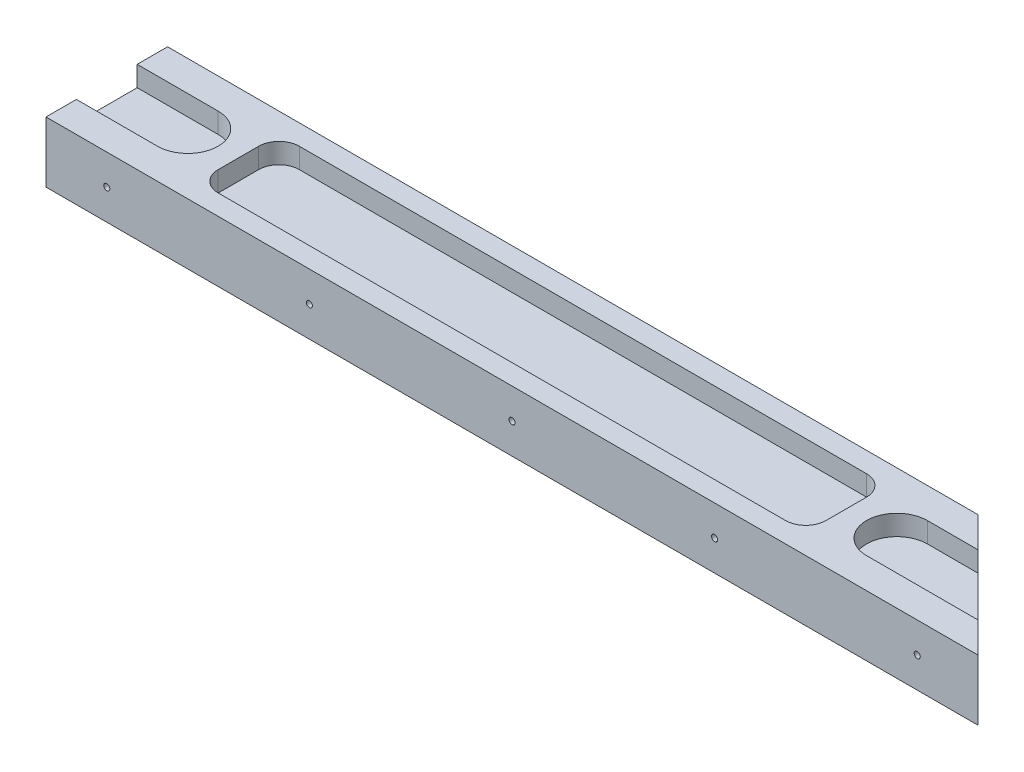
ISO-10303-21;
HEADER;
FILE_DESCRIPTION(('STEP AP214'),'2;1');
FILE_NAME('part.step','',(''),(''),'','','');
FILE_SCHEMA(('AUTOMOTIVE_DESIGN { 1 0 10303 214 1 1 1 1 }'));
ENDSEC;
DATA;
#1=APPLICATION_CONTEXT('core data for automotive mechanical design processes');
#2=APPLICATION_PROTOCOL_DEFINITION('international standard','automotive_design',2000,#1);
#3=PRODUCT_CONTEXT('',#1,'mechanical');
#4=PRODUCT('Part','Part','',(#3));
#5=PRODUCT_RELATED_PRODUCT_CATEGORY('part','',(#4));
#6=PRODUCT_DEFINITION_FORMATION('','',#4);
#7=PRODUCT_DEFINITION_CONTEXT('part definition',#1,'design');
#8=PRODUCT_DEFINITION('design','',#6,#7);
#9=PRODUCT_DEFINITION_SHAPE('','',#8);
#10=(LENGTH_UNIT() NAMED_UNIT(*) SI_UNIT(.MILLI.,.METRE.));
#11=(NAMED_UNIT(*) PLANE_ANGLE_UNIT() SI_UNIT($,.RADIAN.));
#12=(NAMED_UNIT(*) SI_UNIT($,.STERADIAN.) SOLID_ANGLE_UNIT());
#13=UNCERTAINTY_MEASURE_WITH_UNIT(LENGTH_MEASURE(1.E-05),#10,'distance_accuracy_value','');
#14=(GEOMETRIC_REPRESENTATION_CONTEXT(3) GLOBAL_UNCERTAINTY_ASSIGNED_CONTEXT((#13)) GLOBAL_UNIT_ASSIGNED_CONTEXT((#10,
#11,#12)) REPRESENTATION_CONTEXT('',''));
#15=CARTESIAN_POINT('',(0.,0.,0.));
#16=DIRECTION('',(0.,0.,1.));
#17=DIRECTION('',(1.,0.,0.));
#18=AXIS2_PLACEMENT_3D('',#15,#16,#17);
#19=CARTESIAN_POINT('',(0.,15.,-30.));
#20=DIRECTION('',(1.,0.,0.));
#21=DIRECTION('',(0.,0.,-1.));
#22=AXIS2_PLACEMENT_3D('',#19,#20,#21);
#23=PLANE('',#22);
#24=DIRECTION('',(0.,0.,1.));
#25=VECTOR('',#24,1.);
#26=CARTESIAN_POINT('',(0.,0.,-30.));
#27=LINE('',#26,#25);
#28=CARTESIAN_POINT('',(0.,0.,-30.));
#29=VERTEX_POINT('',#28);
#30=CARTESIAN_POINT('',(0.,0.,-22.5));
#31=VERTEX_POINT('',#30);
#32=EDGE_CURVE('E436',#29,#31,#27,.T.);
#33=ORIENTED_EDGE('',*,*,#32,.T.);
#34=DIRECTION('',(0.,-1.,0.));
#35=VECTOR('',#34,1.);
#36=CARTESIAN_POINT('',(0.,5.,-22.5));
#37=LINE('',#36,#35);
#38=CARTESIAN_POINT('',(0.,5.,-22.5));
#39=VERTEX_POINT('',#38);
#40=EDGE_CURVE('E355',#39,#31,#37,.T.);
#41=ORIENTED_EDGE('',*,*,#40,.F.);
#42=DIRECTION('',(0.,0.,-1.));
#43=VECTOR('',#42,1.);
#44=CARTESIAN_POINT('',(0.,5.,-22.5));
#45=LINE('',#44,#43);
#46=CARTESIAN_POINT('',(0.,5.,-7.5));
#47=VERTEX_POINT('',#46);
#48=EDGE_CURVE('E368',#47,#39,#45,.T.);
#49=ORIENTED_EDGE('',*,*,#48,.F.);
#50=DIRECTION('',(0.,-1.,0.));
#51=VECTOR('',#50,1.);
#52=CARTESIAN_POINT('',(0.,5.,-7.5));
#53=LINE('',#52,#51);
#54=CARTESIAN_POINT('',(0.,0.,-7.5));
#55=VERTEX_POINT('',#54);
#56=EDGE_CURVE('E352',#47,#55,#53,.T.);
#57=ORIENTED_EDGE('',*,*,#56,.T.);
#58=CARTESIAN_POINT('',(0.,0.,0.));
#59=VERTEX_POINT('',#58);
#60=EDGE_CURVE('E422',#55,#59,#27,.T.);
#61=ORIENTED_EDGE('',*,*,#60,.T.);
#62=DIRECTION('',(0.,-1.,0.));
#63=VECTOR('',#62,1.);
#64=CARTESIAN_POINT('',(0.,15.,0.));
#65=LINE('',#64,#63);
#66=CARTESIAN_POINT('',(0.,15.,0.));
#67=VERTEX_POINT('',#66);
#68=EDGE_CURVE('E455',#67,#59,#65,.T.);
#69=ORIENTED_EDGE('',*,*,#68,.F.);
#70=DIRECTION('',(0.,0.,1.));
#71=VECTOR('',#70,1.);
#72=CARTESIAN_POINT('',(0.,15.,-30.));
#73=LINE('',#72,#71);
#74=CARTESIAN_POINT('',(0.,15.,-7.50000000000001));
#75=VERTEX_POINT('',#74);
#76=EDGE_CURVE('E427',#75,#67,#73,.T.);
#77=ORIENTED_EDGE('',*,*,#76,.F.);
#78=DIRECTION('',(0.,-1.,0.));
#79=VECTOR('',#78,1.);
#80=CARTESIAN_POINT('',(0.,15.,-7.5));
#81=LINE('',#80,#79);
#82=CARTESIAN_POINT('',(0.,10.,-7.5));
#83=VERTEX_POINT('',#82);
#84=EDGE_CURVE('E416',#75,#83,#81,.T.);
#85=ORIENTED_EDGE('',*,*,#84,.T.);
#86=DIRECTION('',(0.,0.,1.));
#87=VECTOR('',#86,1.);
#88=CARTESIAN_POINT('',(0.,10.,-30.));
#89=LINE('',#88,#87);
#90=CARTESIAN_POINT('',(0.,10.,-22.5));
#91=VERTEX_POINT('',#90);
#92=EDGE_CURVE('E11',#91,#83,#89,.T.);
#93=ORIENTED_EDGE('',*,*,#92,.F.);
#94=DIRECTION('',(0.,1.,0.));
#95=VECTOR('',#94,1.);
#96=CARTESIAN_POINT('',(0.,15.,-22.5));
#97=LINE('',#96,#95);
#98=CARTESIAN_POINT('',(0.,15.,-22.5));
#99=VERTEX_POINT('',#98);
#100=EDGE_CURVE('E419',#91,#99,#97,.T.);
#101=ORIENTED_EDGE('',*,*,#100,.T.);
#102=CARTESIAN_POINT('',(0.,15.,-30.));
#103=VERTEX_POINT('',#102);
#104=EDGE_CURVE('E423',#103,#99,#73,.T.);
#105=ORIENTED_EDGE('',*,*,#104,.F.);
#106=DIRECTION('',(0.,-1.,0.));
#107=VECTOR('',#106,1.);
#108=CARTESIAN_POINT('',(0.,15.,-30.));
#109=LINE('',#108,#107);
#110=EDGE_CURVE('E435',#103,#29,#109,.T.);
#111=ORIENTED_EDGE('',*,*,#110,.T.);
#112=EDGE_LOOP('',(#33,#41,#49,#57,#61,#69,#77,#85,#93,#101,#105,#111));
#113=FACE_BOUND('',#112,.T.);
#114=ADVANCED_FACE('F39',(#113),#23,.F.);
#115=CARTESIAN_POINT('',(0.,15.,0.));
#116=DIRECTION('',(0.,0.,-1.));
#117=DIRECTION('',(-1.,0.,0.));
#118=AXIS2_PLACEMENT_3D('',#115,#116,#117);
#119=PLANE('',#118);
#120=CARTESIAN_POINT('',(15.,7.4999999999993,0.));
#121=DIRECTION('',(0.,0.,1.));
#122=DIRECTION('',(1.,0.,0.));
#123=AXIS2_PLACEMENT_3D('',#120,#121,#122);
#124=CIRCLE('',#123,0.749999999999999);
#125=CARTESIAN_POINT('',(15.75,7.4999999999993,0.));
#126=VERTEX_POINT('',#125);
#127=EDGE_CURVE('E308',#126,#126,#124,.T.);
#128=ORIENTED_EDGE('',*,*,#127,.F.);
#129=EDGE_LOOP('',(#128));
#130=FACE_BOUND('',#129,.T.);
#131=CARTESIAN_POINT('',(65.,7.49999999999965,0.));
#132=DIRECTION('',(0.,0.,1.));
#133=DIRECTION('',(1.,0.,0.));
#134=AXIS2_PLACEMENT_3D('',#131,#132,#133);
#135=CIRCLE('',#134,0.749999999999999);
#136=CARTESIAN_POINT('',(65.75,7.49999999999965,0.));
#137=VERTEX_POINT('',#136);
#138=EDGE_CURVE('E304',#137,#137,#135,.T.);
#139=ORIENTED_EDGE('',*,*,#138,.F.);
#140=EDGE_LOOP('',(#139));
#141=FACE_BOUND('',#140,.T.);
#142=CARTESIAN_POINT('',(215.,7.5,0.));
#143=DIRECTION('',(0.,0.,1.));
#144=DIRECTION('',(1.,0.,0.));
#145=AXIS2_PLACEMENT_3D('',#142,#143,#144);
#146=CIRCLE('',#145,0.749999999999985);
#147=CARTESIAN_POINT('',(215.75,7.5,0.));
#148=VERTEX_POINT('',#147);
#149=EDGE_CURVE('E298',#148,#148,#146,.T.);
#150=ORIENTED_EDGE('',*,*,#149,.F.);
#151=EDGE_LOOP('',(#150));
#152=FACE_BOUND('',#151,.T.);
#153=CARTESIAN_POINT('',(165.,7.5,0.));
#154=DIRECTION('',(0.,0.,1.));
#155=DIRECTION('',(1.,0.,0.));
#156=AXIS2_PLACEMENT_3D('',#153,#154,#155);
#157=CIRCLE('',#156,0.750000000000012);
#158=CARTESIAN_POINT('',(165.75,7.5,0.));
#159=VERTEX_POINT('',#158);
#160=EDGE_CURVE('E297',#159,#159,#157,.T.);
#161=ORIENTED_EDGE('',*,*,#160,.F.);
#162=EDGE_LOOP('',(#161));
#163=FACE_BOUND('',#162,.T.);
#164=CARTESIAN_POINT('',(115.,7.5,0.));
#165=DIRECTION('',(0.,0.,1.));
#166=DIRECTION('',(1.,0.,0.));
#167=AXIS2_PLACEMENT_3D('',#164,#165,#166);
#168=CIRCLE('',#167,0.749999999999999);
#169=CARTESIAN_POINT('',(115.75,7.5,0.));
#170=VERTEX_POINT('',#169);
#171=EDGE_CURVE('E301',#170,#170,#168,.T.);
#172=ORIENTED_EDGE('',*,*,#171,.F.);
#173=EDGE_LOOP('',(#172));
#174=FACE_BOUND('',#173,.T.);
#175=DIRECTION('',(1.,0.,0.));
#176=VECTOR('',#175,1.);
#177=CARTESIAN_POINT('',(0.,0.,0.));
#178=LINE('',#177,#176);
#179=CARTESIAN_POINT('',(230.,0.,0.));
#180=VERTEX_POINT('',#179);
#181=EDGE_CURVE('E439',#59,#180,#178,.T.);
#182=ORIENTED_EDGE('',*,*,#181,.T.);
#183=DIRECTION('',(0.,-1.,0.));
#184=VECTOR('',#183,1.);
#185=CARTESIAN_POINT('',(230.,15.,0.));
#186=LINE('',#185,#184);
#187=CARTESIAN_POINT('',(230.,15.,0.));
#188=VERTEX_POINT('',#187);
#189=EDGE_CURVE('E452',#188,#180,#186,.T.);
#190=ORIENTED_EDGE('',*,*,#189,.F.);
#191=DIRECTION('',(1.,0.,0.));
#192=VECTOR('',#191,1.);
#193=CARTESIAN_POINT('',(0.,15.,0.));
#194=LINE('',#193,#192);
#195=EDGE_CURVE('E426',#67,#188,#194,.T.);
#196=ORIENTED_EDGE('',*,*,#195,.F.);
#197=ORIENTED_EDGE('',*,*,#68,.T.);
#198=EDGE_LOOP('',(#182,#190,#196,#197));
#199=FACE_BOUND('',#198,.T.);
#200=ADVANCED_FACE('F532',(#130,#141,#152,#163,#174,#199),#119,.F.);
#201=CARTESIAN_POINT('',(230.,15.,0.));
#202=DIRECTION('',(-0.707106781186548,0.,0.707106781186547));
#203=DIRECTION('',(0.707106781186547,0.,0.707106781186548));
#204=AXIS2_PLACEMENT_3D('',#201,#202,#203);
#205=PLANE('',#204);
#206=CARTESIAN_POINT('',(215.,7.5,-15.));
#207=DIRECTION('',(-0.707106781186548,0.,0.707106781186547));
#208=DIRECTION('',(0.707106781186547,0.,0.707106781186548));
#209=AXIS2_PLACEMENT_3D('',#206,#207,#208);
#210=ELLIPSE('',#209,1.0606601717798,0.749999999999985);
#211=CARTESIAN_POINT('',(215.75,7.5,-14.25));
#212=VERTEX_POINT('',#211);
#213=EDGE_CURVE('E42',#212,#212,#210,.T.);
#214=ORIENTED_EDGE('',*,*,#213,.T.);
#215=EDGE_LOOP('',(#214));
#216=FACE_BOUND('',#215,.T.);
#217=DIRECTION('',(-0.707106781186547,0.,-0.707106781186548));
#218=VECTOR('',#217,1.);
#219=CARTESIAN_POINT('',(230.,0.,0.));
#220=LINE('',#219,#218);
#221=CARTESIAN_POINT('',(222.5,0.,-7.50000000000001));
#222=VERTEX_POINT('',#221);
#223=EDGE_CURVE('E442',#180,#222,#220,.T.);
#224=ORIENTED_EDGE('',*,*,#223,.T.);
#225=DIRECTION('',(0.,-1.,0.));
#226=VECTOR('',#225,1.);
#227=CARTESIAN_POINT('',(222.5,5.,-7.50000000000001));
#228=LINE('',#227,#226);
#229=CARTESIAN_POINT('',(222.5,5.,-7.50000000000001));
#230=VERTEX_POINT('',#229);
#231=EDGE_CURVE('E342',#230,#222,#228,.T.);
#232=ORIENTED_EDGE('',*,*,#231,.F.);
#233=DIRECTION('',(0.707106781186547,0.,0.707106781186548));
#234=VECTOR('',#233,1.);
#235=CARTESIAN_POINT('',(222.5,5.,-7.50000000000001));
#236=LINE('',#235,#234);
#237=CARTESIAN_POINT('',(207.5,5.,-22.5));
#238=VERTEX_POINT('',#237);
#239=EDGE_CURVE('E327',#238,#230,#236,.T.);
#240=ORIENTED_EDGE('',*,*,#239,.F.);
#241=DIRECTION('',(0.,-1.,0.));
#242=VECTOR('',#241,1.);
#243=CARTESIAN_POINT('',(207.5,5.,-22.5));
#244=LINE('',#243,#242);
#245=CARTESIAN_POINT('',(207.5,0.,-22.5));
#246=VERTEX_POINT('',#245);
#247=EDGE_CURVE('E344',#238,#246,#244,.T.);
#248=ORIENTED_EDGE('',*,*,#247,.T.);
#249=CARTESIAN_POINT('',(200.,0.,-30.));
#250=VERTEX_POINT('',#249);
#251=EDGE_CURVE('E441',#246,#250,#220,.T.);
#252=ORIENTED_EDGE('',*,*,#251,.T.);
#253=DIRECTION('',(0.,-1.,0.));
#254=VECTOR('',#253,1.);
#255=CARTESIAN_POINT('',(200.,15.,-30.));
#256=LINE('',#255,#254);
#257=CARTESIAN_POINT('',(200.,15.,-30.));
#258=VERTEX_POINT('',#257);
#259=EDGE_CURVE('E449',#258,#250,#256,.T.);
#260=ORIENTED_EDGE('',*,*,#259,.F.);
#261=DIRECTION('',(-0.707106781186547,0.,-0.707106781186548));
#262=VECTOR('',#261,1.);
#263=CARTESIAN_POINT('',(230.,15.,0.));
#264=LINE('',#263,#262);
#265=CARTESIAN_POINT('',(207.5,15.,-22.5));
#266=VERTEX_POINT('',#265);
#267=EDGE_CURVE('E429',#266,#258,#264,.T.);
#268=ORIENTED_EDGE('',*,*,#267,.F.);
#269=DIRECTION('',(0.,-1.,0.));
#270=VECTOR('',#269,1.);
#271=CARTESIAN_POINT('',(207.5,15.,-22.5));
#272=LINE('',#271,#270);
#273=CARTESIAN_POINT('',(207.5,10.,-22.5));
#274=VERTEX_POINT('',#273);
#275=EDGE_CURVE('E392',#266,#274,#272,.T.);
#276=ORIENTED_EDGE('',*,*,#275,.T.);
#277=DIRECTION('',(0.707106781186547,0.,0.707106781186548));
#278=VECTOR('',#277,1.);
#279=CARTESIAN_POINT('',(230.,10.,0.));
#280=LINE('',#279,#278);
#281=CARTESIAN_POINT('',(222.5,10.,-7.50000000000001));
#282=VERTEX_POINT('',#281);
#283=EDGE_CURVE('E47',#274,#282,#280,.T.);
#284=ORIENTED_EDGE('',*,*,#283,.T.);
#285=DIRECTION('',(0.,1.,0.));
#286=VECTOR('',#285,1.);
#287=CARTESIAN_POINT('',(222.5,15.,-7.5));
#288=LINE('',#287,#286);
#289=CARTESIAN_POINT('',(222.5,15.,-7.5));
#290=VERTEX_POINT('',#289);
#291=EDGE_CURVE('E413',#282,#290,#288,.T.);
#292=ORIENTED_EDGE('',*,*,#291,.T.);
#293=EDGE_CURVE('E430',#188,#290,#264,.T.);
#294=ORIENTED_EDGE('',*,*,#293,.F.);
#295=ORIENTED_EDGE('',*,*,#189,.T.);
#296=EDGE_LOOP('',(#224,#232,#240,#248,#252,#260,#268,#276,#284,#292,#294,#295));
#297=FACE_BOUND('',#296,.T.);
#298=ADVANCED_FACE('F464',(#216,#297),#205,.F.);
#299=CARTESIAN_POINT('',(200.,15.,-30.));
#300=DIRECTION('',(0.,0.,1.));
#301=DIRECTION('',(1.,0.,0.));
#302=AXIS2_PLACEMENT_3D('',#299,#300,#301);
#303=PLANE('',#302);
#304=CARTESIAN_POINT('',(15.,7.4999999999993,-30.));
#305=DIRECTION('',(0.,0.,1.));
#306=DIRECTION('',(1.,0.,0.));
#307=AXIS2_PLACEMENT_3D('',#304,#305,#306);
#308=CIRCLE('',#307,0.749999999999999);
#309=CARTESIAN_POINT('',(15.75,7.4999999999993,-30.));
#310=VERTEX_POINT('',#309);
#311=EDGE_CURVE('E282',#310,#310,#308,.F.);
#312=ORIENTED_EDGE('',*,*,#311,.F.);
#313=EDGE_LOOP('',(#312));
#314=FACE_BOUND('',#313,.T.);
#315=CARTESIAN_POINT('',(65.,7.49999999999965,-30.));
#316=DIRECTION('',(0.,0.,1.));
#317=DIRECTION('',(1.,0.,0.));
#318=AXIS2_PLACEMENT_3D('',#315,#316,#317);
#319=CIRCLE('',#318,0.749999999999999);
#320=CARTESIAN_POINT('',(65.75,7.49999999999965,-30.));
#321=VERTEX_POINT('',#320);
#322=EDGE_CURVE('E305',#321,#321,#319,.F.);
#323=ORIENTED_EDGE('',*,*,#322,.F.);
#324=EDGE_LOOP('',(#323));
#325=FACE_BOUND('',#324,.T.);
#326=CARTESIAN_POINT('',(165.,7.5,-30.));
#327=DIRECTION('',(0.,0.,1.));
#328=DIRECTION('',(1.,0.,0.));
#329=AXIS2_PLACEMENT_3D('',#326,#327,#328);
#330=CIRCLE('',#329,0.750000000000012);
#331=CARTESIAN_POINT('',(165.75,7.5,-30.));
#332=VERTEX_POINT('',#331);
#333=EDGE_CURVE('E294',#332,#332,#330,.F.);
#334=ORIENTED_EDGE('',*,*,#333,.F.);
#335=EDGE_LOOP('',(#334));
#336=FACE_BOUND('',#335,.T.);
#337=CARTESIAN_POINT('',(115.,7.5,-30.));
#338=DIRECTION('',(0.,0.,1.));
#339=DIRECTION('',(1.,0.,0.));
#340=AXIS2_PLACEMENT_3D('',#337,#338,#339);
#341=CIRCLE('',#340,0.749999999999999);
#342=CARTESIAN_POINT('',(115.75,7.5,-30.));
#343=VERTEX_POINT('',#342);
#344=EDGE_CURVE('E317',#343,#343,#341,.F.);
#345=ORIENTED_EDGE('',*,*,#344,.F.);
#346=EDGE_LOOP('',(#345));
#347=FACE_BOUND('',#346,.T.);
#348=DIRECTION('',(-1.,0.,0.));
#349=VECTOR('',#348,1.);
#350=CARTESIAN_POINT('',(200.,0.,-30.));
#351=LINE('',#350,#349);
#352=EDGE_CURVE('E445',#250,#29,#351,.T.);
#353=ORIENTED_EDGE('',*,*,#352,.T.);
#354=ORIENTED_EDGE('',*,*,#110,.F.);
#355=DIRECTION('',(-1.,0.,0.));
#356=VECTOR('',#355,1.);
#357=CARTESIAN_POINT('',(200.,15.,-30.));
#358=LINE('',#357,#356);
#359=EDGE_CURVE('E433',#258,#103,#358,.T.);
#360=ORIENTED_EDGE('',*,*,#359,.F.);
#361=ORIENTED_EDGE('',*,*,#259,.T.);
#362=EDGE_LOOP('',(#353,#354,#360,#361));
#363=FACE_BOUND('',#362,.T.);
#364=ADVANCED_FACE('F512',(#314,#325,#336,#347,#363),#303,.F.);
#365=CARTESIAN_POINT('',(0.,15.,0.));
#366=DIRECTION('',(0.,1.,0.));
#367=DIRECTION('',(0.,0.,1.));
#368=AXIS2_PLACEMENT_3D('',#365,#366,#367);
#369=PLANE('',#368);
#370=CARTESIAN_POINT('',(177.5,15.,-20.));
#371=DIRECTION('',(0.,1.,0.));
#372=DIRECTION('',(0.,0.,-1.));
#373=AXIS2_PLACEMENT_3D('',#370,#371,#372);
#374=CIRCLE('',#373,5.);
#375=CARTESIAN_POINT('',(182.5,15.,-20.));
#376=VERTEX_POINT('',#375);
#377=CARTESIAN_POINT('',(177.5,15.,-25.));
#378=VERTEX_POINT('',#377);
#379=EDGE_CURVE('E54',#376,#378,#374,.T.);
#380=ORIENTED_EDGE('',*,*,#379,.F.);
#381=DIRECTION('',(0.,0.,-1.));
#382=VECTOR('',#381,1.);
#383=CARTESIAN_POINT('',(182.5,15.,-20.));
#384=LINE('',#383,#382);
#385=CARTESIAN_POINT('',(182.5,15.,-10.));
#386=VERTEX_POINT('',#385);
#387=EDGE_CURVE('E244',#386,#376,#384,.T.);
#388=ORIENTED_EDGE('',*,*,#387,.F.);
#389=CARTESIAN_POINT('',(177.5,15.,-10.));
#390=DIRECTION('',(0.,1.,0.));
#391=DIRECTION('',(0.,0.,1.));
#392=AXIS2_PLACEMENT_3D('',#389,#390,#391);
#393=CIRCLE('',#392,5.);
#394=CARTESIAN_POINT('',(177.5,15.,-5.));
#395=VERTEX_POINT('',#394);
#396=EDGE_CURVE('E247',#395,#386,#393,.T.);
#397=ORIENTED_EDGE('',*,*,#396,.F.);
#398=DIRECTION('',(1.,0.,0.));
#399=VECTOR('',#398,1.);
#400=CARTESIAN_POINT('',(37.5,15.,-5.));
#401=LINE('',#400,#399);
#402=CARTESIAN_POINT('',(37.5,15.,-5.));
#403=VERTEX_POINT('',#402);
#404=EDGE_CURVE('E275',#403,#395,#401,.T.);
#405=ORIENTED_EDGE('',*,*,#404,.F.);
#406=CARTESIAN_POINT('',(37.5,15.,-10.));
#407=DIRECTION('',(0.,1.,0.));
#408=DIRECTION('',(0.,0.,1.));
#409=AXIS2_PLACEMENT_3D('',#406,#407,#408);
#410=CIRCLE('',#409,5.);
#411=CARTESIAN_POINT('',(32.5,15.,-10.));
#412=VERTEX_POINT('',#411);
#413=EDGE_CURVE('E272',#412,#403,#410,.T.);
#414=ORIENTED_EDGE('',*,*,#413,.F.);
#415=DIRECTION('',(0.,0.,1.));
#416=VECTOR('',#415,1.);
#417=CARTESIAN_POINT('',(32.5,15.,-20.));
#418=LINE('',#417,#416);
#419=CARTESIAN_POINT('',(32.5,15.,-20.));
#420=VERTEX_POINT('',#419);
#421=EDGE_CURVE('E269',#420,#412,#418,.T.);
#422=ORIENTED_EDGE('',*,*,#421,.F.);
#423=CARTESIAN_POINT('',(37.5,15.,-20.));
#424=DIRECTION('',(0.,1.,0.));
#425=DIRECTION('',(0.,0.,1.));
#426=AXIS2_PLACEMENT_3D('',#423,#424,#425);
#427=CIRCLE('',#426,5.);
#428=CARTESIAN_POINT('',(37.5,15.,-25.));
#429=VERTEX_POINT('',#428);
#430=EDGE_CURVE('E266',#429,#420,#427,.T.);
#431=ORIENTED_EDGE('',*,*,#430,.F.);
#432=DIRECTION('',(-1.,0.,0.));
#433=VECTOR('',#432,1.);
#434=CARTESIAN_POINT('',(37.5,15.,-25.));
#435=LINE('',#434,#433);
#436=EDGE_CURVE('E264',#378,#429,#435,.T.);
#437=ORIENTED_EDGE('',*,*,#436,.F.);
#438=EDGE_LOOP('',(#380,#388,#397,#405,#414,#422,#431,#437));
#439=FACE_BOUND('',#438,.T.);
#440=DIRECTION('',(-1.,0.,0.));
#441=VECTOR('',#440,1.);
#442=CARTESIAN_POINT('',(-20.,15.,-22.5));
#443=LINE('',#442,#441);
#444=CARTESIAN_POINT('',(20.,15.,-22.5));
#445=VERTEX_POINT('',#444);
#446=EDGE_CURVE('E378',#445,#99,#443,.T.);
#447=ORIENTED_EDGE('',*,*,#446,.F.);
#448=CARTESIAN_POINT('',(20.,15.,-15.));
#449=DIRECTION('',(0.,1.,0.));
#450=DIRECTION('',(0.,0.,1.));
#451=AXIS2_PLACEMENT_3D('',#448,#449,#450);
#452=CIRCLE('',#451,7.5);
#453=CARTESIAN_POINT('',(20.,15.,-7.50000000000001));
#454=VERTEX_POINT('',#453);
#455=EDGE_CURVE('E385',#454,#445,#452,.T.);
#456=ORIENTED_EDGE('',*,*,#455,.F.);
#457=DIRECTION('',(1.,0.,0.));
#458=VECTOR('',#457,1.);
#459=CARTESIAN_POINT('',(0.,15.,-7.5));
#460=LINE('',#459,#458);
#461=EDGE_CURVE('E460',#75,#454,#460,.T.);
#462=ORIENTED_EDGE('',*,*,#461,.F.);
#463=ORIENTED_EDGE('',*,*,#76,.T.);
#464=ORIENTED_EDGE('',*,*,#195,.T.);
#465=ORIENTED_EDGE('',*,*,#293,.T.);
#466=DIRECTION('',(1.,0.,0.));
#467=VECTOR('',#466,1.);
#468=CARTESIAN_POINT('',(235.,15.,-7.5));
#469=LINE('',#468,#467);
#470=CARTESIAN_POINT('',(195.,15.,-7.50000000000001));
#471=VERTEX_POINT('',#470);
#472=EDGE_CURVE('E400',#471,#290,#469,.T.);
#473=ORIENTED_EDGE('',*,*,#472,.F.);
#474=CARTESIAN_POINT('',(195.,15.,-15.));
#475=DIRECTION('',(0.,1.,0.));
#476=DIRECTION('',(0.,0.,-1.));
#477=AXIS2_PLACEMENT_3D('',#474,#475,#476);
#478=CIRCLE('',#477,7.5);
#479=CARTESIAN_POINT('',(195.,15.,-22.5));
#480=VERTEX_POINT('',#479);
#481=EDGE_CURVE('E388',#480,#471,#478,.T.);
#482=ORIENTED_EDGE('',*,*,#481,.F.);
#483=DIRECTION('',(-1.,0.,0.));
#484=VECTOR('',#483,1.);
#485=CARTESIAN_POINT('',(0.,15.,-22.5));
#486=LINE('',#485,#484);
#487=EDGE_CURVE('E458',#266,#480,#486,.T.);
#488=ORIENTED_EDGE('',*,*,#487,.F.);
#489=ORIENTED_EDGE('',*,*,#267,.T.);
#490=ORIENTED_EDGE('',*,*,#359,.T.);
#491=ORIENTED_EDGE('',*,*,#104,.T.);
#492=EDGE_LOOP('',(#447,#456,#462,#463,#464,#465,#473,#482,#488,#489,#490,#491));
#493=FACE_BOUND('',#492,.T.);
#494=ADVANCED_FACE('F484',(#439,#493),#369,.T.);
#495=CARTESIAN_POINT('',(0.,0.,0.));
#496=DIRECTION('',(0.,1.,0.));
#497=DIRECTION('',(0.,0.,1.));
#498=AXIS2_PLACEMENT_3D('',#495,#496,#497);
#499=PLANE('',#498);
#500=CARTESIAN_POINT('',(195.,0.,-15.));
#501=DIRECTION('',(0.,-1.,0.));
#502=DIRECTION('',(0.,0.,-1.));
#503=AXIS2_PLACEMENT_3D('',#500,#501,#502);
#504=CIRCLE('',#503,7.5);
#505=CARTESIAN_POINT('',(195.,0.,-7.50000000000001));
#506=VERTEX_POINT('',#505);
#507=CARTESIAN_POINT('',(195.,0.,-22.5));
#508=VERTEX_POINT('',#507);
#509=EDGE_CURVE('E62',#506,#508,#504,.T.);
#510=ORIENTED_EDGE('',*,*,#509,.F.);
#511=DIRECTION('',(-1.,0.,0.));
#512=VECTOR('',#511,1.);
#513=CARTESIAN_POINT('',(195.,0.,-7.50000000000001));
#514=LINE('',#513,#512);
#515=EDGE_CURVE('E324',#222,#506,#514,.T.);
#516=ORIENTED_EDGE('',*,*,#515,.F.);
#517=ORIENTED_EDGE('',*,*,#223,.F.);
#518=ORIENTED_EDGE('',*,*,#181,.F.);
#519=ORIENTED_EDGE('',*,*,#60,.F.);
#520=DIRECTION('',(-1.,0.,0.));
#521=VECTOR('',#520,1.);
#522=CARTESIAN_POINT('',(0.,0.,-7.5));
#523=LINE('',#522,#521);
#524=CARTESIAN_POINT('',(20.,0.,-7.50000000000001));
#525=VERTEX_POINT('',#524);
#526=EDGE_CURVE('E362',#525,#55,#523,.T.);
#527=ORIENTED_EDGE('',*,*,#526,.F.);
#528=CARTESIAN_POINT('',(20.,0.,-15.));
#529=DIRECTION('',(0.,-1.,0.));
#530=DIRECTION('',(0.,0.,-1.));
#531=AXIS2_PLACEMENT_3D('',#528,#529,#530);
#532=CIRCLE('',#531,7.5);
#533=CARTESIAN_POINT('',(20.,0.,-22.5));
#534=VERTEX_POINT('',#533);
#535=EDGE_CURVE('E335',#534,#525,#532,.T.);
#536=ORIENTED_EDGE('',*,*,#535,.F.);
#537=DIRECTION('',(1.,0.,0.));
#538=VECTOR('',#537,1.);
#539=CARTESIAN_POINT('',(20.,0.,-22.5));
#540=LINE('',#539,#538);
#541=EDGE_CURVE('E359',#31,#534,#540,.T.);
#542=ORIENTED_EDGE('',*,*,#541,.F.);
#543=ORIENTED_EDGE('',*,*,#32,.F.);
#544=ORIENTED_EDGE('',*,*,#352,.F.);
#545=ORIENTED_EDGE('',*,*,#251,.F.);
#546=DIRECTION('',(1.,0.,0.));
#547=VECTOR('',#546,1.);
#548=CARTESIAN_POINT('',(207.5,0.,-22.5));
#549=LINE('',#548,#547);
#550=EDGE_CURVE('E334',#508,#246,#549,.T.);
#551=ORIENTED_EDGE('',*,*,#550,.F.);
#552=EDGE_LOOP('',(#510,#516,#517,#518,#519,#527,#536,#542,#543,#544,#545,#551));
#553=FACE_BOUND('',#552,.T.);
#554=ADVANCED_FACE('F493',(#553),#499,.F.);
#555=CARTESIAN_POINT('',(235.,10.,-15.));
#556=DIRECTION('',(0.,-1.,0.));
#557=DIRECTION('',(0.,0.,-1.));
#558=AXIS2_PLACEMENT_3D('',#555,#556,#557);
#559=PLANE('',#558);
#560=DIRECTION('',(-1.,0.,0.));
#561=VECTOR('',#560,1.);
#562=CARTESIAN_POINT('',(235.,10.,-22.5));
#563=LINE('',#562,#561);
#564=CARTESIAN_POINT('',(195.,10.,-22.5));
#565=VERTEX_POINT('',#564);
#566=EDGE_CURVE('E402',#274,#565,#563,.T.);
#567=ORIENTED_EDGE('',*,*,#566,.T.);
#568=CARTESIAN_POINT('',(195.,10.,-15.));
#569=DIRECTION('',(0.,1.,0.));
#570=DIRECTION('',(0.,0.,-1.));
#571=AXIS2_PLACEMENT_3D('',#568,#569,#570);
#572=CIRCLE('',#571,7.5);
#573=CARTESIAN_POINT('',(195.,10.,-7.50000000000001));
#574=VERTEX_POINT('',#573);
#575=EDGE_CURVE('E407',#565,#574,#572,.T.);
#576=ORIENTED_EDGE('',*,*,#575,.T.);
#577=DIRECTION('',(1.,0.,0.));
#578=VECTOR('',#577,1.);
#579=CARTESIAN_POINT('',(235.,10.,-7.5));
#580=LINE('',#579,#578);
#581=EDGE_CURVE('E398',#574,#282,#580,.T.);
#582=ORIENTED_EDGE('',*,*,#581,.T.);
#583=ORIENTED_EDGE('',*,*,#283,.F.);
#584=EDGE_LOOP('',(#567,#576,#582,#583));
#585=FACE_BOUND('',#584,.T.);
#586=ADVANCED_FACE('F469',(#585),#559,.F.);
#587=CARTESIAN_POINT('',(235.,10.,-7.5));
#588=DIRECTION('',(0.,0.,1.));
#589=DIRECTION('',(1.,0.,0.));
#590=AXIS2_PLACEMENT_3D('',#587,#588,#589);
#591=PLANE('',#590);
#592=ORIENTED_EDGE('',*,*,#581,.F.);
#593=DIRECTION('',(0.,1.,0.));
#594=VECTOR('',#593,1.);
#595=CARTESIAN_POINT('',(195.,10.,-7.50000000000001));
#596=LINE('',#595,#594);
#597=EDGE_CURVE('E341',#574,#471,#596,.T.);
#598=ORIENTED_EDGE('',*,*,#597,.T.);
#599=ORIENTED_EDGE('',*,*,#472,.T.);
#600=ORIENTED_EDGE('',*,*,#291,.F.);
#601=EDGE_LOOP('',(#592,#598,#599,#600));
#602=FACE_BOUND('',#601,.T.);
#603=ADVANCED_FACE('F480',(#602),#591,.F.);
#604=CARTESIAN_POINT('',(235.,10.,-22.5));
#605=DIRECTION('',(0.,0.,-1.));
#606=DIRECTION('',(-1.,0.,0.));
#607=AXIS2_PLACEMENT_3D('',#604,#605,#606);
#608=PLANE('',#607);
#609=ORIENTED_EDGE('',*,*,#487,.T.);
#610=DIRECTION('',(0.,1.,0.));
#611=VECTOR('',#610,1.);
#612=CARTESIAN_POINT('',(195.,10.,-22.5));
#613=LINE('',#612,#611);
#614=EDGE_CURVE('E395',#565,#480,#613,.T.);
#615=ORIENTED_EDGE('',*,*,#614,.F.);
#616=ORIENTED_EDGE('',*,*,#566,.F.);
#617=ORIENTED_EDGE('',*,*,#275,.F.);
#618=EDGE_LOOP('',(#609,#615,#616,#617));
#619=FACE_BOUND('',#618,.T.);
#620=ADVANCED_FACE('F473',(#619),#608,.F.);
#621=CARTESIAN_POINT('',(195.,10.,-15.));
#622=DIRECTION('',(0.,1.,0.));
#623=DIRECTION('',(0.,0.,1.));
#624=AXIS2_PLACEMENT_3D('',#621,#622,#623);
#625=CYLINDRICAL_SURFACE('',#624,7.5);
#626=ORIENTED_EDGE('',*,*,#481,.T.);
#627=ORIENTED_EDGE('',*,*,#597,.F.);
#628=ORIENTED_EDGE('',*,*,#575,.F.);
#629=ORIENTED_EDGE('',*,*,#614,.T.);
#630=EDGE_LOOP('',(#626,#627,#628,#629));
#631=FACE_BOUND('',#630,.T.);
#632=ADVANCED_FACE('F478',(#631),#625,.F.);
#633=CARTESIAN_POINT('',(-20.,10.,-15.));
#634=DIRECTION('',(0.,1.,0.));
#635=DIRECTION('',(0.,0.,1.));
#636=AXIS2_PLACEMENT_3D('',#633,#634,#635);
#637=PLANE('',#636);
#638=ORIENTED_EDGE('',*,*,#92,.T.);
#639=DIRECTION('',(1.,0.,0.));
#640=VECTOR('',#639,1.);
#641=CARTESIAN_POINT('',(-20.,10.,-7.5));
#642=LINE('',#641,#640);
#643=CARTESIAN_POINT('',(20.,10.,-7.50000000000001));
#644=VERTEX_POINT('',#643);
#645=EDGE_CURVE('E375',#83,#644,#642,.T.);
#646=ORIENTED_EDGE('',*,*,#645,.T.);
#647=CARTESIAN_POINT('',(20.,10.,-15.));
#648=DIRECTION('',(0.,1.,0.));
#649=DIRECTION('',(0.,0.,1.));
#650=AXIS2_PLACEMENT_3D('',#647,#648,#649);
#651=CIRCLE('',#650,7.5);
#652=CARTESIAN_POINT('',(20.,10.,-22.5));
#653=VERTEX_POINT('',#652);
#654=EDGE_CURVE('E377',#644,#653,#651,.T.);
#655=ORIENTED_EDGE('',*,*,#654,.T.);
#656=DIRECTION('',(-1.,0.,0.));
#657=VECTOR('',#656,1.);
#658=CARTESIAN_POINT('',(-20.,10.,-22.5));
#659=LINE('',#658,#657);
#660=EDGE_CURVE('E381',#653,#91,#659,.T.);
#661=ORIENTED_EDGE('',*,*,#660,.T.);
#662=EDGE_LOOP('',(#638,#646,#655,#661));
#663=FACE_BOUND('',#662,.T.);
#664=ADVANCED_FACE('F522',(#663),#637,.T.);
#665=CARTESIAN_POINT('',(-20.,10.,-22.5));
#666=DIRECTION('',(0.,0.,-1.));
#667=DIRECTION('',(-1.,0.,0.));
#668=AXIS2_PLACEMENT_3D('',#665,#666,#667);
#669=PLANE('',#668);
#670=ORIENTED_EDGE('',*,*,#660,.F.);
#671=DIRECTION('',(0.,1.,0.));
#672=VECTOR('',#671,1.);
#673=CARTESIAN_POINT('',(20.,10.,-22.5));
#674=LINE('',#673,#672);
#675=EDGE_CURVE('E390',#653,#445,#674,.T.);
#676=ORIENTED_EDGE('',*,*,#675,.T.);
#677=ORIENTED_EDGE('',*,*,#446,.T.);
#678=ORIENTED_EDGE('',*,*,#100,.F.);
#679=EDGE_LOOP('',(#670,#676,#677,#678));
#680=FACE_BOUND('',#679,.T.);
#681=ADVANCED_FACE('F520',(#680),#669,.F.);
#682=CARTESIAN_POINT('',(-20.,10.,-7.5));
#683=DIRECTION('',(0.,0.,1.));
#684=DIRECTION('',(1.,0.,0.));
#685=AXIS2_PLACEMENT_3D('',#682,#683,#684);
#686=PLANE('',#685);
#687=ORIENTED_EDGE('',*,*,#461,.T.);
#688=DIRECTION('',(0.,1.,0.));
#689=VECTOR('',#688,1.);
#690=CARTESIAN_POINT('',(20.,10.,-7.50000000000001));
#691=LINE('',#690,#689);
#692=EDGE_CURVE('E384',#644,#454,#691,.T.);
#693=ORIENTED_EDGE('',*,*,#692,.F.);
#694=ORIENTED_EDGE('',*,*,#645,.F.);
#695=ORIENTED_EDGE('',*,*,#84,.F.);
#696=EDGE_LOOP('',(#687,#693,#694,#695));
#697=FACE_BOUND('',#696,.T.);
#698=ADVANCED_FACE('F561',(#697),#686,.F.);
#699=CARTESIAN_POINT('',(20.,10.,-15.));
#700=DIRECTION('',(0.,1.,0.));
#701=DIRECTION('',(0.,0.,1.));
#702=AXIS2_PLACEMENT_3D('',#699,#700,#701);
#703=CYLINDRICAL_SURFACE('',#702,7.5);
#704=ORIENTED_EDGE('',*,*,#455,.T.);
#705=ORIENTED_EDGE('',*,*,#675,.F.);
#706=ORIENTED_EDGE('',*,*,#654,.F.);
#707=ORIENTED_EDGE('',*,*,#692,.T.);
#708=EDGE_LOOP('',(#704,#705,#706,#707));
#709=FACE_BOUND('',#708,.T.);
#710=ADVANCED_FACE('F527',(#709),#703,.F.);
#711=CARTESIAN_POINT('',(20.,5.,-15.));
#712=DIRECTION('',(0.,-1.,0.));
#713=DIRECTION('',(0.,0.,-1.));
#714=AXIS2_PLACEMENT_3D('',#711,#712,#713);
#715=CYLINDRICAL_SURFACE('',#714,7.5);
#716=ORIENTED_EDGE('',*,*,#535,.T.);
#717=DIRECTION('',(0.,-1.,0.));
#718=VECTOR('',#717,1.);
#719=CARTESIAN_POINT('',(20.,5.,-7.50000000000001));
#720=LINE('',#719,#718);
#721=CARTESIAN_POINT('',(20.,5.,-7.50000000000001));
#722=VERTEX_POINT('',#721);
#723=EDGE_CURVE('E348',#722,#525,#720,.T.);
#724=ORIENTED_EDGE('',*,*,#723,.F.);
#725=CARTESIAN_POINT('',(20.,5.,-15.));
#726=DIRECTION('',(0.,-1.,0.));
#727=DIRECTION('',(0.,0.,-1.));
#728=AXIS2_PLACEMENT_3D('',#725,#726,#727);
#729=CIRCLE('',#728,7.5);
#730=CARTESIAN_POINT('',(20.,5.,-22.5));
#731=VERTEX_POINT('',#730);
#732=EDGE_CURVE('E363',#731,#722,#729,.T.);
#733=ORIENTED_EDGE('',*,*,#732,.F.);
#734=DIRECTION('',(0.,-1.,0.));
#735=VECTOR('',#734,1.);
#736=CARTESIAN_POINT('',(20.,5.,-22.5));
#737=LINE('',#736,#735);
#738=EDGE_CURVE('E357',#731,#534,#737,.T.);
#739=ORIENTED_EDGE('',*,*,#738,.T.);
#740=EDGE_LOOP('',(#716,#724,#733,#739));
#741=FACE_BOUND('',#740,.T.);
#742=ADVANCED_FACE('F566',(#741),#715,.F.);
#743=CARTESIAN_POINT('',(20.,5.,-22.5));
#744=DIRECTION('',(0.,0.,-1.));
#745=DIRECTION('',(-1.,0.,0.));
#746=AXIS2_PLACEMENT_3D('',#743,#744,#745);
#747=PLANE('',#746);
#748=ORIENTED_EDGE('',*,*,#541,.T.);
#749=ORIENTED_EDGE('',*,*,#738,.F.);
#750=DIRECTION('',(1.,0.,0.));
#751=VECTOR('',#750,1.);
#752=CARTESIAN_POINT('',(20.,5.,-22.5));
#753=LINE('',#752,#751);
#754=EDGE_CURVE('E351',#39,#731,#753,.T.);
#755=ORIENTED_EDGE('',*,*,#754,.F.);
#756=ORIENTED_EDGE('',*,*,#40,.T.);
#757=EDGE_LOOP('',(#748,#749,#755,#756));
#758=FACE_BOUND('',#757,.T.);
#759=ADVANCED_FACE('F577',(#758),#747,.F.);
#760=CARTESIAN_POINT('',(0.,5.,-7.5));
#761=DIRECTION('',(0.,0.,1.));
#762=DIRECTION('',(1.,0.,0.));
#763=AXIS2_PLACEMENT_3D('',#760,#761,#762);
#764=PLANE('',#763);
#765=ORIENTED_EDGE('',*,*,#526,.T.);
#766=ORIENTED_EDGE('',*,*,#56,.F.);
#767=DIRECTION('',(-1.,0.,0.));
#768=VECTOR('',#767,1.);
#769=CARTESIAN_POINT('',(0.,5.,-7.5));
#770=LINE('',#769,#768);
#771=EDGE_CURVE('E370',#722,#47,#770,.T.);
#772=ORIENTED_EDGE('',*,*,#771,.F.);
#773=ORIENTED_EDGE('',*,*,#723,.T.);
#774=EDGE_LOOP('',(#765,#766,#772,#773));
#775=FACE_BOUND('',#774,.T.);
#776=ADVANCED_FACE('F575',(#775),#764,.F.);
#777=CARTESIAN_POINT('',(20.,5.,-15.));
#778=DIRECTION('',(0.,-1.,0.));
#779=DIRECTION('',(0.,0.,-1.));
#780=AXIS2_PLACEMENT_3D('',#777,#778,#779);
#781=PLANE('',#780);
#782=ORIENTED_EDGE('',*,*,#732,.T.);
#783=ORIENTED_EDGE('',*,*,#771,.T.);
#784=ORIENTED_EDGE('',*,*,#48,.T.);
#785=ORIENTED_EDGE('',*,*,#754,.T.);
#786=EDGE_LOOP('',(#782,#783,#784,#785));
#787=FACE_BOUND('',#786,.T.);
#788=ADVANCED_FACE('F571',(#787),#781,.T.);
#789=CARTESIAN_POINT('',(195.,5.,-15.));
#790=DIRECTION('',(0.,-1.,0.));
#791=DIRECTION('',(0.,0.,-1.));
#792=AXIS2_PLACEMENT_3D('',#789,#790,#791);
#793=CYLINDRICAL_SURFACE('',#792,7.5);
#794=ORIENTED_EDGE('',*,*,#509,.T.);
#795=DIRECTION('',(0.,-1.,0.));
#796=VECTOR('',#795,1.);
#797=CARTESIAN_POINT('',(195.,5.,-22.5));
#798=LINE('',#797,#796);
#799=CARTESIAN_POINT('',(195.,5.,-22.5));
#800=VERTEX_POINT('',#799);
#801=EDGE_CURVE('E332',#800,#508,#798,.T.);
#802=ORIENTED_EDGE('',*,*,#801,.F.);
#803=CARTESIAN_POINT('',(195.,5.,-15.));
#804=DIRECTION('',(0.,-1.,0.));
#805=DIRECTION('',(0.,0.,-1.));
#806=AXIS2_PLACEMENT_3D('',#803,#804,#805);
#807=CIRCLE('',#806,7.5);
#808=CARTESIAN_POINT('',(195.,5.,-7.50000000000001));
#809=VERTEX_POINT('',#808);
#810=EDGE_CURVE('E320',#809,#800,#807,.T.);
#811=ORIENTED_EDGE('',*,*,#810,.F.);
#812=DIRECTION('',(0.,-1.,0.));
#813=VECTOR('',#812,1.);
#814=CARTESIAN_POINT('',(195.,5.,-7.50000000000001));
#815=LINE('',#814,#813);
#816=EDGE_CURVE('E339',#809,#506,#815,.T.);
#817=ORIENTED_EDGE('',*,*,#816,.T.);
#818=EDGE_LOOP('',(#794,#802,#811,#817));
#819=FACE_BOUND('',#818,.T.);
#820=ADVANCED_FACE('F574',(#819),#793,.F.);
#821=CARTESIAN_POINT('',(195.,5.,-7.50000000000001));
#822=DIRECTION('',(0.,0.,1.));
#823=DIRECTION('',(1.,0.,0.));
#824=AXIS2_PLACEMENT_3D('',#821,#822,#823);
#825=PLANE('',#824);
#826=ORIENTED_EDGE('',*,*,#515,.T.);
#827=ORIENTED_EDGE('',*,*,#816,.F.);
#828=DIRECTION('',(-1.,0.,0.));
#829=VECTOR('',#828,1.);
#830=CARTESIAN_POINT('',(195.,5.,-7.50000000000001));
#831=LINE('',#830,#829);
#832=EDGE_CURVE('E329',#230,#809,#831,.T.);
#833=ORIENTED_EDGE('',*,*,#832,.F.);
#834=ORIENTED_EDGE('',*,*,#231,.T.);
#835=EDGE_LOOP('',(#826,#827,#833,#834));
#836=FACE_BOUND('',#835,.T.);
#837=ADVANCED_FACE('F497',(#836),#825,.F.);
#838=CARTESIAN_POINT('',(207.5,5.,-22.5));
#839=DIRECTION('',(0.,0.,-1.));
#840=DIRECTION('',(-1.,0.,0.));
#841=AXIS2_PLACEMENT_3D('',#838,#839,#840);
#842=PLANE('',#841);
#843=ORIENTED_EDGE('',*,*,#550,.T.);
#844=ORIENTED_EDGE('',*,*,#247,.F.);
#845=DIRECTION('',(1.,0.,0.));
#846=VECTOR('',#845,1.);
#847=CARTESIAN_POINT('',(207.5,5.,-22.5));
#848=LINE('',#847,#846);
#849=EDGE_CURVE('E323',#800,#238,#848,.T.);
#850=ORIENTED_EDGE('',*,*,#849,.F.);
#851=ORIENTED_EDGE('',*,*,#801,.T.);
#852=EDGE_LOOP('',(#843,#844,#850,#851));
#853=FACE_BOUND('',#852,.T.);
#854=ADVANCED_FACE('F506',(#853),#842,.F.);
#855=CARTESIAN_POINT('',(195.,5.,-15.));
#856=DIRECTION('',(0.,-1.,0.));
#857=DIRECTION('',(0.,0.,-1.));
#858=AXIS2_PLACEMENT_3D('',#855,#856,#857);
#859=PLANE('',#858);
#860=ORIENTED_EDGE('',*,*,#810,.T.);
#861=ORIENTED_EDGE('',*,*,#849,.T.);
#862=ORIENTED_EDGE('',*,*,#239,.T.);
#863=ORIENTED_EDGE('',*,*,#832,.T.);
#864=EDGE_LOOP('',(#860,#861,#862,#863));
#865=FACE_BOUND('',#864,.T.);
#866=ADVANCED_FACE('F503',(#865),#859,.T.);
#867=CARTESIAN_POINT('',(115.,7.5,-32.1213203435597));
#868=DIRECTION('',(0.,0.,1.));
#869=DIRECTION('',(1.,0.,0.));
#870=AXIS2_PLACEMENT_3D('',#867,#868,#869);
#871=CYLINDRICAL_SURFACE('',#870,0.749999999999999);
#872=ORIENTED_EDGE('',*,*,#344,.T.);
#873=EDGE_LOOP('',(#872));
#874=FACE_BOUND('',#873,.T.);
#875=ORIENTED_EDGE('',*,*,#171,.T.);
#876=EDGE_LOOP('',(#875));
#877=FACE_BOUND('',#876,.T.);
#878=ADVANCED_FACE('F594',(#874,#877),#871,.F.);
#879=CARTESIAN_POINT('',(165.,7.5,-32.1213203435597));
#880=DIRECTION('',(0.,0.,1.));
#881=DIRECTION('',(1.,0.,0.));
#882=AXIS2_PLACEMENT_3D('',#879,#880,#881);
#883=CYLINDRICAL_SURFACE('',#882,0.750000000000012);
#884=ORIENTED_EDGE('',*,*,#333,.T.);
#885=EDGE_LOOP('',(#884));
#886=FACE_BOUND('',#885,.T.);
#887=ORIENTED_EDGE('',*,*,#160,.T.);
#888=EDGE_LOOP('',(#887));
#889=FACE_BOUND('',#888,.T.);
#890=ADVANCED_FACE('F597',(#886,#889),#883,.F.);
#891=CARTESIAN_POINT('',(65.,7.49999999999965,-32.1213203435597));
#892=DIRECTION('',(0.,0.,1.));
#893=DIRECTION('',(1.,0.,0.));
#894=AXIS2_PLACEMENT_3D('',#891,#892,#893);
#895=CYLINDRICAL_SURFACE('',#894,0.749999999999999);
#896=ORIENTED_EDGE('',*,*,#322,.T.);
#897=EDGE_LOOP('',(#896));
#898=FACE_BOUND('',#897,.T.);
#899=ORIENTED_EDGE('',*,*,#138,.T.);
#900=EDGE_LOOP('',(#899));
#901=FACE_BOUND('',#900,.T.);
#902=ADVANCED_FACE('F603',(#898,#901),#895,.F.);
#903=CARTESIAN_POINT('',(15.,7.4999999999993,-32.1213203435597));
#904=DIRECTION('',(0.,0.,1.));
#905=DIRECTION('',(1.,0.,0.));
#906=AXIS2_PLACEMENT_3D('',#903,#904,#905);
#907=CYLINDRICAL_SURFACE('',#906,0.749999999999999);
#908=ORIENTED_EDGE('',*,*,#311,.T.);
#909=EDGE_LOOP('',(#908));
#910=FACE_BOUND('',#909,.T.);
#911=ORIENTED_EDGE('',*,*,#127,.T.);
#912=EDGE_LOOP('',(#911));
#913=FACE_BOUND('',#912,.T.);
#914=ADVANCED_FACE('F599',(#910,#913),#907,.F.);
#915=CARTESIAN_POINT('',(215.,7.5,-32.1213203435597));
#916=DIRECTION('',(0.,0.,1.));
#917=DIRECTION('',(1.,0.,0.));
#918=AXIS2_PLACEMENT_3D('',#915,#916,#917);
#919=CYLINDRICAL_SURFACE('',#918,0.749999999999985);
#920=ORIENTED_EDGE('',*,*,#149,.T.);
#921=EDGE_LOOP('',(#920));
#922=FACE_BOUND('',#921,.T.);
#923=ORIENTED_EDGE('',*,*,#213,.F.);
#924=EDGE_LOOP('',(#923));
#925=FACE_BOUND('',#924,.T.);
#926=ADVANCED_FACE('F602',(#922,#925),#919,.F.);
#927=CARTESIAN_POINT('',(177.5,10.,-20.));
#928=DIRECTION('',(0.,1.,0.));
#929=DIRECTION('',(0.,0.,1.));
#930=AXIS2_PLACEMENT_3D('',#927,#928,#929);
#931=CYLINDRICAL_SURFACE('',#930,5.);
#932=ORIENTED_EDGE('',*,*,#379,.T.);
#933=DIRECTION('',(0.,1.,0.));
#934=VECTOR('',#933,1.);
#935=CARTESIAN_POINT('',(177.5,10.,-25.));
#936=LINE('',#935,#934);
#937=CARTESIAN_POINT('',(177.5,10.,-25.));
#938=VERTEX_POINT('',#937);
#939=EDGE_CURVE('E221',#938,#378,#936,.T.);
#940=ORIENTED_EDGE('',*,*,#939,.F.);
#941=CARTESIAN_POINT('',(177.5,10.,-20.));
#942=DIRECTION('',(0.,1.,0.));
#943=DIRECTION('',(0.,0.,-1.));
#944=AXIS2_PLACEMENT_3D('',#941,#942,#943);
#945=CIRCLE('',#944,5.);
#946=CARTESIAN_POINT('',(182.5,10.,-20.));
#947=VERTEX_POINT('',#946);
#948=EDGE_CURVE('E225',#947,#938,#945,.T.);
#949=ORIENTED_EDGE('',*,*,#948,.F.);
#950=DIRECTION('',(0.,1.,0.));
#951=VECTOR('',#950,1.);
#952=CARTESIAN_POINT('',(182.5,10.,-20.));
#953=LINE('',#952,#951);
#954=EDGE_CURVE('E280',#947,#376,#953,.T.);
#955=ORIENTED_EDGE('',*,*,#954,.T.);
#956=EDGE_LOOP('',(#932,#940,#949,#955));
#957=FACE_BOUND('',#956,.T.);
#958=ADVANCED_FACE('F223',(#957),#931,.F.);
#959=CARTESIAN_POINT('',(182.5,10.,-20.));
#960=DIRECTION('',(1.,0.,0.));
#961=DIRECTION('',(0.,0.,-1.));
#962=AXIS2_PLACEMENT_3D('',#959,#960,#961);
#963=PLANE('',#962);
#964=ORIENTED_EDGE('',*,*,#387,.T.);
#965=ORIENTED_EDGE('',*,*,#954,.F.);
#966=DIRECTION('',(0.,0.,-1.));
#967=VECTOR('',#966,1.);
#968=CARTESIAN_POINT('',(182.5,10.,-20.));
#969=LINE('',#968,#967);
#970=CARTESIAN_POINT('',(182.5,10.,-10.));
#971=VERTEX_POINT('',#970);
#972=EDGE_CURVE('E231',#971,#947,#969,.T.);
#973=ORIENTED_EDGE('',*,*,#972,.F.);
#974=DIRECTION('',(0.,1.,0.));
#975=VECTOR('',#974,1.);
#976=CARTESIAN_POINT('',(182.5,10.,-10.));
#977=LINE('',#976,#975);
#978=EDGE_CURVE('E283',#971,#386,#977,.T.);
#979=ORIENTED_EDGE('',*,*,#978,.T.);
#980=EDGE_LOOP('',(#964,#965,#973,#979));
#981=FACE_BOUND('',#980,.T.);
#982=ADVANCED_FACE('F616',(#981),#963,.F.);
#983=CARTESIAN_POINT('',(177.5,10.,-10.));
#984=DIRECTION('',(0.,1.,0.));
#985=DIRECTION('',(0.,0.,1.));
#986=AXIS2_PLACEMENT_3D('',#983,#984,#985);
#987=CYLINDRICAL_SURFACE('',#986,5.);
#988=ORIENTED_EDGE('',*,*,#396,.T.);
#989=ORIENTED_EDGE('',*,*,#978,.F.);
#990=CARTESIAN_POINT('',(177.5,10.,-10.));
#991=DIRECTION('',(0.,1.,0.));
#992=DIRECTION('',(0.,0.,1.));
#993=AXIS2_PLACEMENT_3D('',#990,#991,#992);
#994=CIRCLE('',#993,5.);
#995=CARTESIAN_POINT('',(177.5,10.,-5.));
#996=VERTEX_POINT('',#995);
#997=EDGE_CURVE('E260',#996,#971,#994,.T.);
#998=ORIENTED_EDGE('',*,*,#997,.F.);
#999=DIRECTION('',(0.,1.,0.));
#1000=VECTOR('',#999,1.);
#1001=CARTESIAN_POINT('',(177.5,10.,-5.));
#1002=LINE('',#1001,#1000);
#1003=EDGE_CURVE('E285',#996,#395,#1002,.T.);
#1004=ORIENTED_EDGE('',*,*,#1003,.T.);
#1005=EDGE_LOOP('',(#988,#989,#998,#1004));
#1006=FACE_BOUND('',#1005,.T.);
#1007=ADVANCED_FACE('F634',(#1006),#987,.F.);
#1008=CARTESIAN_POINT('',(37.5,10.,-5.));
#1009=DIRECTION('',(0.,0.,1.));
#1010=DIRECTION('',(1.,0.,0.));
#1011=AXIS2_PLACEMENT_3D('',#1008,#1009,#1010);
#1012=PLANE('',#1011);
#1013=ORIENTED_EDGE('',*,*,#404,.T.);
#1014=ORIENTED_EDGE('',*,*,#1003,.F.);
#1015=DIRECTION('',(1.,0.,0.));
#1016=VECTOR('',#1015,1.);
#1017=CARTESIAN_POINT('',(37.5,10.,-5.));
#1018=LINE('',#1017,#1016);
#1019=CARTESIAN_POINT('',(37.5,10.,-5.));
#1020=VERTEX_POINT('',#1019);
#1021=EDGE_CURVE('E257',#1020,#996,#1018,.T.);
#1022=ORIENTED_EDGE('',*,*,#1021,.F.);
#1023=DIRECTION('',(0.,1.,0.));
#1024=VECTOR('',#1023,1.);
#1025=CARTESIAN_POINT('',(37.5,10.,-5.));
#1026=LINE('',#1025,#1024);
#1027=EDGE_CURVE('E287',#1020,#403,#1026,.T.);
#1028=ORIENTED_EDGE('',*,*,#1027,.T.);
#1029=EDGE_LOOP('',(#1013,#1014,#1022,#1028));
#1030=FACE_BOUND('',#1029,.T.);
#1031=ADVANCED_FACE('F630',(#1030),#1012,.F.);
#1032=CARTESIAN_POINT('',(37.5,10.,-10.));
#1033=DIRECTION('',(0.,1.,0.));
#1034=DIRECTION('',(0.,0.,1.));
#1035=AXIS2_PLACEMENT_3D('',#1032,#1033,#1034);
#1036=CYLINDRICAL_SURFACE('',#1035,5.);
#1037=ORIENTED_EDGE('',*,*,#413,.T.);
#1038=ORIENTED_EDGE('',*,*,#1027,.F.);
#1039=CARTESIAN_POINT('',(37.5,10.,-10.));
#1040=DIRECTION('',(0.,1.,0.));
#1041=DIRECTION('',(0.,0.,1.));
#1042=AXIS2_PLACEMENT_3D('',#1039,#1040,#1041);
#1043=CIRCLE('',#1042,5.);
#1044=CARTESIAN_POINT('',(32.5,10.,-10.));
#1045=VERTEX_POINT('',#1044);
#1046=EDGE_CURVE('E254',#1045,#1020,#1043,.T.);
#1047=ORIENTED_EDGE('',*,*,#1046,.F.);
#1048=DIRECTION('',(0.,1.,0.));
#1049=VECTOR('',#1048,1.);
#1050=CARTESIAN_POINT('',(32.5,10.,-10.));
#1051=LINE('',#1050,#1049);
#1052=EDGE_CURVE('E289',#1045,#412,#1051,.T.);
#1053=ORIENTED_EDGE('',*,*,#1052,.T.);
#1054=EDGE_LOOP('',(#1037,#1038,#1047,#1053));
#1055=FACE_BOUND('',#1054,.T.);
#1056=ADVANCED_FACE('F626',(#1055),#1036,.F.);
#1057=CARTESIAN_POINT('',(32.5,10.,-20.));
#1058=DIRECTION('',(-1.,0.,0.));
#1059=DIRECTION('',(0.,0.,1.));
#1060=AXIS2_PLACEMENT_3D('',#1057,#1058,#1059);
#1061=PLANE('',#1060);
#1062=ORIENTED_EDGE('',*,*,#421,.T.);
#1063=ORIENTED_EDGE('',*,*,#1052,.F.);
#1064=DIRECTION('',(0.,0.,1.));
#1065=VECTOR('',#1064,1.);
#1066=CARTESIAN_POINT('',(32.5,10.,-20.));
#1067=LINE('',#1066,#1065);
#1068=CARTESIAN_POINT('',(32.5,10.,-20.));
#1069=VERTEX_POINT('',#1068);
#1070=EDGE_CURVE('E251',#1069,#1045,#1067,.T.);
#1071=ORIENTED_EDGE('',*,*,#1070,.F.);
#1072=DIRECTION('',(0.,1.,0.));
#1073=VECTOR('',#1072,1.);
#1074=CARTESIAN_POINT('',(32.5,10.,-20.));
#1075=LINE('',#1074,#1073);
#1076=EDGE_CURVE('E291',#1069,#420,#1075,.T.);
#1077=ORIENTED_EDGE('',*,*,#1076,.T.);
#1078=EDGE_LOOP('',(#1062,#1063,#1071,#1077));
#1079=FACE_BOUND('',#1078,.T.);
#1080=ADVANCED_FACE('F622',(#1079),#1061,.F.);
#1081=CARTESIAN_POINT('',(37.5,10.,-20.));
#1082=DIRECTION('',(0.,1.,0.));
#1083=DIRECTION('',(0.,0.,1.));
#1084=AXIS2_PLACEMENT_3D('',#1081,#1082,#1083);
#1085=CYLINDRICAL_SURFACE('',#1084,5.);
#1086=ORIENTED_EDGE('',*,*,#430,.T.);
#1087=ORIENTED_EDGE('',*,*,#1076,.F.);
#1088=CARTESIAN_POINT('',(37.5,10.,-20.));
#1089=DIRECTION('',(0.,1.,0.));
#1090=DIRECTION('',(0.,0.,1.));
#1091=AXIS2_PLACEMENT_3D('',#1088,#1089,#1090);
#1092=CIRCLE('',#1091,5.);
#1093=CARTESIAN_POINT('',(37.5,10.,-25.));
#1094=VERTEX_POINT('',#1093);
#1095=EDGE_CURVE('E239',#1094,#1069,#1092,.T.);
#1096=ORIENTED_EDGE('',*,*,#1095,.F.);
#1097=DIRECTION('',(0.,1.,0.));
#1098=VECTOR('',#1097,1.);
#1099=CARTESIAN_POINT('',(37.5,10.,-25.));
#1100=LINE('',#1099,#1098);
#1101=EDGE_CURVE('E230',#1094,#429,#1100,.T.);
#1102=ORIENTED_EDGE('',*,*,#1101,.T.);
#1103=EDGE_LOOP('',(#1086,#1087,#1096,#1102));
#1104=FACE_BOUND('',#1103,.T.);
#1105=ADVANCED_FACE('F619',(#1104),#1085,.F.);
#1106=CARTESIAN_POINT('',(37.5,10.,-25.));
#1107=DIRECTION('',(0.,0.,-1.));
#1108=DIRECTION('',(-1.,0.,0.));
#1109=AXIS2_PLACEMENT_3D('',#1106,#1107,#1108);
#1110=PLANE('',#1109);
#1111=ORIENTED_EDGE('',*,*,#436,.T.);
#1112=ORIENTED_EDGE('',*,*,#1101,.F.);
#1113=DIRECTION('',(-1.,0.,0.));
#1114=VECTOR('',#1113,1.);
#1115=CARTESIAN_POINT('',(37.5,10.,-25.));
#1116=LINE('',#1115,#1114);
#1117=EDGE_CURVE('E234',#938,#1094,#1116,.T.);
#1118=ORIENTED_EDGE('',*,*,#1117,.F.);
#1119=ORIENTED_EDGE('',*,*,#939,.T.);
#1120=EDGE_LOOP('',(#1111,#1112,#1118,#1119));
#1121=FACE_BOUND('',#1120,.T.);
#1122=ADVANCED_FACE('F235',(#1121),#1110,.F.);
#1123=CARTESIAN_POINT('',(177.5,10.,-20.));
#1124=DIRECTION('',(0.,-1.,0.));
#1125=DIRECTION('',(0.,0.,-1.));
#1126=AXIS2_PLACEMENT_3D('',#1123,#1124,#1125);
#1127=PLANE('',#1126);
#1128=ORIENTED_EDGE('',*,*,#948,.T.);
#1129=ORIENTED_EDGE('',*,*,#1117,.T.);
#1130=ORIENTED_EDGE('',*,*,#1095,.T.);
#1131=ORIENTED_EDGE('',*,*,#1070,.T.);
#1132=ORIENTED_EDGE('',*,*,#1046,.T.);
#1133=ORIENTED_EDGE('',*,*,#1021,.T.);
#1134=ORIENTED_EDGE('',*,*,#997,.T.);
#1135=ORIENTED_EDGE('',*,*,#972,.T.);
#1136=EDGE_LOOP('',(#1128,#1129,#1130,#1131,#1132,#1133,#1134,#1135));
#1137=FACE_BOUND('',#1136,.T.);
#1138=ADVANCED_FACE('F241',(#1137),#1127,.F.);
#1139=CLOSED_SHELL('',(#114,#200,#298,#364,#494,#554,#586,#603,#620,#632,#664,#681,#698,#710,
#742,#759,#776,#788,#820,#837,#854,#866,#878,#890,#902,#914,#926,#958,#982,#1007,#1031,#1056,
#1080,#1105,#1122,#1138));
#1140=MANIFOLD_SOLID_BREP('B2',#1139);
#1141=ADVANCED_BREP_SHAPE_REPRESENTATION('',(#18,#1140),#14);
#1142=SHAPE_DEFINITION_REPRESENTATION(#9,#1141);
ENDSEC;
END-ISO-10303-21;
